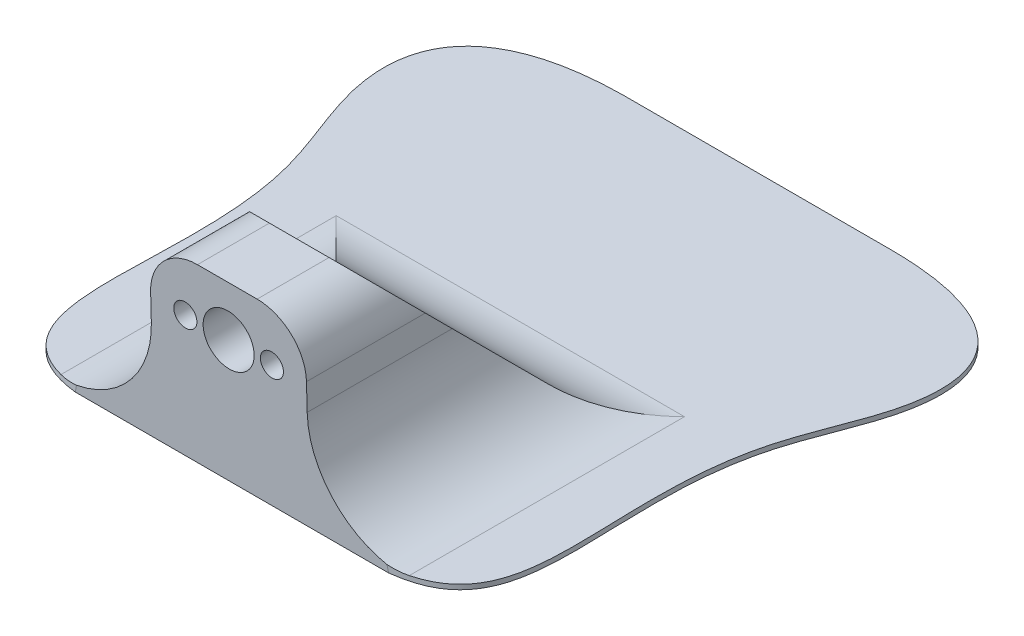
ISO-10303-21;
HEADER;
FILE_DESCRIPTION(('STEP AP214'),'2;1');
FILE_NAME('part.step','',(''),(''),'','','');
FILE_SCHEMA(('AUTOMOTIVE_DESIGN { 1 0 10303 214 1 1 1 1 }'));
ENDSEC;
DATA;
#1=APPLICATION_CONTEXT('core data for automotive mechanical design processes');
#2=APPLICATION_PROTOCOL_DEFINITION('international standard','automotive_design',2000,#1);
#3=PRODUCT_CONTEXT('',#1,'mechanical');
#4=PRODUCT('Part','Part','',(#3));
#5=PRODUCT_RELATED_PRODUCT_CATEGORY('part','',(#4));
#6=PRODUCT_DEFINITION_FORMATION('','',#4);
#7=PRODUCT_DEFINITION_CONTEXT('part definition',#1,'design');
#8=PRODUCT_DEFINITION('design','',#6,#7);
#9=PRODUCT_DEFINITION_SHAPE('','',#8);
#10=(LENGTH_UNIT() NAMED_UNIT(*) SI_UNIT(.MILLI.,.METRE.));
#11=(NAMED_UNIT(*) PLANE_ANGLE_UNIT() SI_UNIT($,.RADIAN.));
#12=(NAMED_UNIT(*) SI_UNIT($,.STERADIAN.) SOLID_ANGLE_UNIT());
#13=UNCERTAINTY_MEASURE_WITH_UNIT(LENGTH_MEASURE(1.E-05),#10,'distance_accuracy_value','');
#14=(GEOMETRIC_REPRESENTATION_CONTEXT(3) GLOBAL_UNCERTAINTY_ASSIGNED_CONTEXT((#13)) GLOBAL_UNIT_ASSIGNED_CONTEXT((#10,
#11,#12)) REPRESENTATION_CONTEXT('',''));
#15=CARTESIAN_POINT('',(0.,0.,0.));
#16=DIRECTION('',(0.,0.,1.));
#17=DIRECTION('',(1.,0.,0.));
#18=AXIS2_PLACEMENT_3D('',#15,#16,#17);
#19=CARTESIAN_POINT('',(-4.6739709889537,0.5,-25.2396955481044));
#20=DIRECTION('',(0.,-1.,0.));
#21=DIRECTION('',(0.,0.,-1.));
#22=AXIS2_PLACEMENT_3D('',#19,#20,#21);
#23=PLANE('',#22);
#24=DIRECTION('',(1.,0.,0.));
#25=VECTOR('',#24,1.);
#26=CARTESIAN_POINT('',(28.9884499999999,0.5,-21.7133491553784));
#27=LINE('',#26,#25);
#28=CARTESIAN_POINT('',(2.78844999999993,0.5,-21.7133491553784));
#29=VERTEX_POINT('',#28);
#30=CARTESIAN_POINT('',(38.9884499999999,0.5,-21.7133491553784));
#31=VERTEX_POINT('',#30);
#32=EDGE_CURVE('E152',#29,#31,#27,.T.);
#33=ORIENTED_EDGE('',*,*,#32,.T.);
#34=DIRECTION('',(0.,0.,-1.));
#35=VECTOR('',#34,1.);
#36=CARTESIAN_POINT('',(38.9884499999999,0.5,7.22878646835256));
#37=LINE('',#36,#35);
#38=CARTESIAN_POINT('',(38.9884500124217,0.5,6.8943912135416));
#39=VERTEX_POINT('',#38);
#40=EDGE_CURVE('E159',#31,#39,#37,.F.);
#41=ORIENTED_EDGE('',*,*,#40,.T.);
#42=CARTESIAN_POINT('',(36.3864345000184,0.5,7.32002908522591));
#43=CARTESIAN_POINT('',(36.6500242820969,0.5,7.28961487960146));
#44=CARTESIAN_POINT('',(36.9136140641755,0.5,7.25920067397702));
#45=CARTESIAN_POINT('',(37.177203846254,0.5,7.22878646835257));
#46=CARTESIAN_POINT('',(49.9434541489255,0.5,5.75575758727522));
#47=CARTESIAN_POINT('',(40.3835490058038,0.5,-12.5557863206709));
#48=CARTESIAN_POINT('',(53.7471422480391,0.5,-42.0087566636716));
#49=CARTESIAN_POINT('',(46.0041197782125,0.5,-47.3617429324616));
#50=CARTESIAN_POINT('',(34.939575722507,0.5,-47.4788841437172));
#51=B_SPLINE_CURVE_WITH_KNOTS('',3,(#42,#43,#44,#45,#46,#47,#48,#49,#50),.UNSPECIFIED.,.F.,.F.,
(4,3,1,1,4),(-0.01,0.,0.484322654770731,0.584322654770731,1.),.UNSPECIFIED.);
#52=CARTESIAN_POINT('',(34.939575722507,0.5,-47.4788841437172));
#53=VERTEX_POINT('',#52);
#54=EDGE_CURVE('E318',#39,#53,#51,.T.);
#55=ORIENTED_EDGE('',*,*,#54,.T.);
#56=DIRECTION('',(-1.,0.,0.));
#57=VECTOR('',#56,1.);
#58=CARTESIAN_POINT('',(6.83732427749298,0.5,-47.4788841437172));
#59=LINE('',#58,#57);
#60=CARTESIAN_POINT('',(6.83732427749298,0.5,-47.4788841437172));
#61=VERTEX_POINT('',#60);
#62=EDGE_CURVE('E245',#53,#61,#59,.T.);
#63=ORIENTED_EDGE('',*,*,#62,.T.);
#64=CARTESIAN_POINT('',(6.83732427749298,0.5,-47.4788841437172));
#65=CARTESIAN_POINT('',(-4.22721977821252,0.5,-47.3617429324616));
#66=CARTESIAN_POINT('',(-11.9702422480391,0.5,-42.0087566636716));
#67=CARTESIAN_POINT('',(1.39335099419624,0.5,-12.5557863206709));
#68=CARTESIAN_POINT('',(-8.16655414892549,0.5,5.75575758727522));
#69=CARTESIAN_POINT('',(4.599696153746,0.5,7.22878646835257));
#70=CARTESIAN_POINT('',(4.86328593582453,0.5,7.25920067397702));
#71=CARTESIAN_POINT('',(5.12687571790307,0.5,7.28961487960146));
#72=CARTESIAN_POINT('',(5.39046549998161,0.5,7.32002908522591));
#73=B_SPLINE_CURVE_WITH_KNOTS('',3,(#64,#65,#66,#67,#68,#69,#70,#71,#72),.UNSPECIFIED.,.F.,.F.,
(4,1,1,3,4),(0.,0.415677345229269,0.515677345229269,1.,1.01),.UNSPECIFIED.);
#74=CARTESIAN_POINT('',(2.78844998757792,0.5,6.8943912135415));
#75=VERTEX_POINT('',#74);
#76=EDGE_CURVE('E239',#61,#75,#73,.T.);
#77=ORIENTED_EDGE('',*,*,#76,.T.);
#78=DIRECTION('',(0.,0.,1.));
#79=VECTOR('',#78,1.);
#80=CARTESIAN_POINT('',(2.78844999999993,0.5,-17.5712135316475));
#81=LINE('',#80,#79);
#82=EDGE_CURVE('E149',#75,#29,#81,.F.);
#83=ORIENTED_EDGE('',*,*,#82,.T.);
#84=EDGE_LOOP('',(#33,#41,#55,#63,#77,#83));
#85=FACE_BOUND('',#84,.T.);
#86=ADVANCED_FACE('F34',(#85),#23,.F.);
#87=DIRECTION('',(0.,-1.,0.));
#88=VECTOR('',#87,1.);
#89=SURFACE_OF_LINEAR_EXTRUSION('',#73,#88);
#90=CARTESIAN_POINT('',(6.83732427749298,0.,-47.4788841437172));
#91=CARTESIAN_POINT('',(-4.22721977821252,0.,-47.3617429324616));
#92=CARTESIAN_POINT('',(-11.9702422480391,0.,-42.0087566636716));
#93=CARTESIAN_POINT('',(1.39335099419624,0.,-12.5557863206709));
#94=CARTESIAN_POINT('',(-8.16655414892549,0.,5.75575758727522));
#95=CARTESIAN_POINT('',(4.599696153746,0.,7.22878646835257));
#96=B_SPLINE_CURVE_WITH_KNOTS('',3,(#90,#91,#92,#93,#94,#95),.UNSPECIFIED.,.F.,.F.,(4,1,1,4),
(0.,0.415677345229269,0.515677345229269,1.),.UNSPECIFIED.);
#97=CARTESIAN_POINT('',(6.83732427749298,0.,-47.4788841437172));
#98=VERTEX_POINT('',#97);
#99=CARTESIAN_POINT('',(4.59969615374586,0.,7.22878646835257));
#100=VERTEX_POINT('',#99);
#101=EDGE_CURVE('E243',#98,#100,#96,.T.);
#102=ORIENTED_EDGE('',*,*,#101,.T.);
#103=CARTESIAN_POINT('',(5.55974244386924,4.23031023157279,7.33956104028986));
#104=CARTESIAN_POINT('',(5.23972701382816,2.82020682104853,7.30263618297743));
#105=CARTESIAN_POINT('',(4.91971158378708,1.41010341052427,7.26571132566501));
#106=CARTESIAN_POINT('',(4.599696153746,0.,7.22878646835258));
#107=B_SPLINE_CURVE_WITH_KNOTS('',3,(#103,#104,#105,#106),.UNSPECIFIED.,.F.,.F.,(4,4),(0.,
4.33929539675702),.UNSPECIFIED.);
#108=CARTESIAN_POINT('',(4.75760310470983,0.695794981222961,7.2470065011591));
#109=VERTEX_POINT('',#108);
#110=EDGE_CURVE('E54',#109,#100,#107,.T.);
#111=ORIENTED_EDGE('',*,*,#110,.F.);
#112=CARTESIAN_POINT('',(7.94876410123277,1.93430339221513,7.61521738537024));
#113=CARTESIAN_POINT('',(7.8185397477749,1.8558481551436,7.60019150016783));
#114=CARTESIAN_POINT('',(7.68654139562263,1.78037754063306,7.5849609202059));
#115=CARTESIAN_POINT('',(7.41925221802812,1.63553344413779,7.55411985951734));
#116=CARTESIAN_POINT('',(7.28396079035984,1.56616108824197,7.53850930930308));
#117=CARTESIAN_POINT('',(7.01037199565174,1.43366208977386,7.50694137492371));
#118=CARTESIAN_POINT('',(6.87207425299372,1.37053623319269,7.49098394741869));
#119=CARTESIAN_POINT('',(6.59276668808544,1.25066109334822,7.45875613931531));
#120=CARTESIAN_POINT('',(6.45175669208742,1.19391222020042,7.44248573866778));
#121=CARTESIAN_POINT('',(6.17086864402309,1.08824151701192,7.4100756238545));
#122=CARTESIAN_POINT('',(6.03104980496022,1.03916000326227,7.39394274003757));
#123=CARTESIAN_POINT('',(5.74940352127678,0.947267840793661,7.36144492960829));
#124=CARTESIAN_POINT('',(5.6075762916,0.904456526499824,7.34508002782696));
#125=CARTESIAN_POINT('',(5.39355462537564,0.845005818529113,7.32038567404525));
#126=CARTESIAN_POINT('',(5.32200512268738,0.825984335620318,7.31213024444259));
#127=CARTESIAN_POINT('',(5.17850514393236,0.789535739898241,7.29557168754518));
#128=CARTESIAN_POINT('',(5.10655466662855,0.772108632006693,7.28726856010327));
#129=CARTESIAN_POINT('',(4.96230726538062,0.738861684558242,7.2706277943966));
#130=CARTESIAN_POINT('',(4.89001043813777,0.723041420963189,7.26229016584412));
#131=CARTESIAN_POINT('',(4.78132162409226,0.700518796000133,7.24974030565067));
#132=CARTESIAN_POINT('',(4.74505130857059,0.693212528180663,7.24554976934542));
#133=CARTESIAN_POINT('',(4.67242964078505,0.679002625545482,7.23718724140127));
#134=CARTESIAN_POINT('',(4.63607828870988,0.672098989793265,7.23301524971926));
#135=CARTESIAN_POINT('',(4.57469743707804,0.660794431230181,7.22588080854615));
#136=CARTESIAN_POINT('',(4.5496841869695,0.656286292170405,7.22294833678208));
#137=CARTESIAN_POINT('',(4.49964135092248,0.647463788520553,7.21693651337868));
#138=CARTESIAN_POINT('',(4.4746117651042,0.643149422520676,7.21385716280832));
#139=CARTESIAN_POINT('',(4.39949938218127,0.63049655472066,7.20442929760614));
#140=CARTESIAN_POINT('',(4.3493911851425,0.622447956368572,7.19789076443767));
#141=CARTESIAN_POINT('',(4.24915468017341,0.60712826807159,7.18427566031628));
#142=CARTESIAN_POINT('',(4.19902639418293,0.599856798474209,7.17719935500037));
#143=CARTESIAN_POINT('',(4.09874458259897,0.586086041825539,7.16249311473654));
#144=CARTESIAN_POINT('',(4.04859105653316,0.579586769808635,7.15486316901411));
#145=CARTESIAN_POINT('',(3.89815689674463,0.561249905430508,7.13111990734865));
#146=CARTESIAN_POINT('',(3.79786668674859,0.550567769374469,7.11414830646827));
#147=CARTESIAN_POINT('',(3.5961835282013,0.532154134573792,7.07754725645148));
#148=CARTESIAN_POINT('',(3.49479264137807,0.524461586840095,7.05788695946069));
#149=CARTESIAN_POINT('',(3.29230173393441,0.512186250460437,7.01591388743383));
#150=CARTESIAN_POINT('',(3.19120194255127,0.507605466720039,6.99359941317231));
#151=CARTESIAN_POINT('',(2.98942194410813,0.50150867159369,6.94614718673769));
#152=CARTESIAN_POINT('',(2.88874254439162,0.499997054800256,6.92100544057632));
#153=CARTESIAN_POINT('',(2.78844999963088,0.5,6.89439121673995));
#154=B_SPLINE_CURVE_WITH_KNOTS('',3,(#112,#113,#114,#115,#116,#117,#118,#119,#120,#121,#122,
#123,#124,#125,#126,#127,#128,#129,#130,#131,#132,#133,#134,#135,#136,#137,#138,#139,#140,#141,
#142,#143,#144,#145,#146,#147,#148,#149,#150,#151,#152,#153),.UNSPECIFIED.,.F.,.F.,(4,2,2,2,2,2,
2,2,2,2,2,2,2,2,2,2,2,2,2,2,4),(0.,0.458276964730314,0.91663837672993,1.37505739076855,
1.83350586972253,2.28054125449008,2.72752915249064,2.95099510100084,3.17446173931294,
3.39786925183782,3.50957371598139,3.6212779202943,3.6980315730695,3.77478466733108,
3.92828540893553,4.0817108143419,4.23513920639161,4.54188585543004,4.85250485539088,
5.16332379743983,5.4745874732178),.UNSPECIFIED.);
#155=EDGE_CURVE('E45',#109,#75,#154,.T.);
#156=ORIENTED_EDGE('',*,*,#155,.T.);
#157=ORIENTED_EDGE('',*,*,#76,.F.);
#158=DIRECTION('',(0.,-1.,0.));
#159=VECTOR('',#158,1.);
#160=CARTESIAN_POINT('',(6.83732427749298,0.5,-47.4788841437172));
#161=LINE('',#160,#159);
#162=EDGE_CURVE('E231',#61,#98,#161,.T.);
#163=ORIENTED_EDGE('',*,*,#162,.T.);
#164=EDGE_LOOP('',(#102,#111,#156,#157,#163));
#165=FACE_BOUND('',#164,.T.);
#166=ADVANCED_FACE('F204',(#165),#89,.F.);
#167=CARTESIAN_POINT('',(4.59969615374586,0.,7.22878646835257));
#168=DIRECTION('',(0.,-0.0261769483078732,0.999657324975557));
#169=DIRECTION('',(0.,-0.999657324975557,-0.0261769483078732));
#170=AXIS2_PLACEMENT_3D('',#167,#168,#169);
#171=PLANE('',#170);
#172=CARTESIAN_POINT('',(25.3884499999999,13.,7.569203448752));
#173=DIRECTION('',(0.,-0.0261769483078732,0.999657324975557));
#174=DIRECTION('',(0.,0.999657324975557,0.0261769483078732));
#175=AXIS2_PLACEMENT_3D('',#172,#173,#174);
#176=ELLIPSE('',#175,1.20041135098904,1.2);
#177=CARTESIAN_POINT('',(25.3884499999999,14.2,7.60062655463502));
#178=VERTEX_POINT('',#177);
#179=EDGE_CURVE('E345',#178,#178,#176,.T.);
#180=ORIENTED_EDGE('',*,*,#179,.F.);
#181=EDGE_LOOP('',(#180));
#182=FACE_BOUND('',#181,.T.);
#183=CARTESIAN_POINT('',(16.3884499999999,13.,7.569203448752));
#184=DIRECTION('',(0.,-0.0261769483078732,0.999657324975557));
#185=DIRECTION('',(0.,0.999657324975557,0.0261769483078732));
#186=AXIS2_PLACEMENT_3D('',#183,#184,#185);
#187=ELLIPSE('',#186,1.20041135098904,1.2);
#188=CARTESIAN_POINT('',(16.3884499999999,14.2,7.60062655463502));
#189=VERTEX_POINT('',#188);
#190=EDGE_CURVE('E298',#189,#189,#187,.T.);
#191=ORIENTED_EDGE('',*,*,#190,.F.);
#192=EDGE_LOOP('',(#191));
#193=FACE_BOUND('',#192,.T.);
#194=CARTESIAN_POINT('',(20.8884499999999,13.,7.569203448752));
#195=DIRECTION('',(0.,-0.0261769483078732,0.999657324975557));
#196=DIRECTION('',(0.,0.999657324975557,0.0261769483078732));
#197=AXIS2_PLACEMENT_3D('',#194,#195,#196);
#198=ELLIPSE('',#197,2.6509084001008,2.65);
#199=CARTESIAN_POINT('',(20.8884499999999,15.65,7.63859614091034));
#200=VERTEX_POINT('',#199);
#201=EDGE_CURVE('E286',#200,#200,#198,.T.);
#202=ORIENTED_EDGE('',*,*,#201,.F.);
#203=EDGE_LOOP('',(#202));
#204=FACE_BOUND('',#203,.T.);
#205=DIRECTION('',(0.,0.999657324975557,0.0261769483078732));
#206=VECTOR('',#205,1.);
#207=CARTESIAN_POINT('',(28.9884499999999,18.2874602430044,7.7076604679755));
#208=LINE('',#207,#206);
#209=CARTESIAN_POINT('',(28.9884499999999,13.3,7.57705922522275));
#210=VERTEX_POINT('',#209);
#211=CARTESIAN_POINT('',(28.9884499999999,10.5,7.50373864482903));
#212=VERTEX_POINT('',#211);
#213=EDGE_CURVE('E123',#210,#212,#208,.F.);
#214=ORIENTED_EDGE('',*,*,#213,.F.);
#215=CARTESIAN_POINT('',(23.9884499999999,13.3,7.57705922522275));
#216=DIRECTION('',(0.,-0.0261769483078732,0.999657324975557));
#217=DIRECTION('',(0.,-0.999657324975557,-0.0261769483078732));
#218=AXIS2_PLACEMENT_3D('',#215,#216,#217);
#219=ELLIPSE('',#218,5.00171396245434,5.);
#220=CARTESIAN_POINT('',(23.9884499999999,18.3,7.70798883306869));
#221=VERTEX_POINT('',#220);
#222=EDGE_CURVE('E39',#210,#221,#219,.T.);
#223=ORIENTED_EDGE('',*,*,#222,.T.);
#224=DIRECTION('',(-1.,0.,0.));
#225=VECTOR('',#224,1.);
#226=CARTESIAN_POINT('',(0.,18.3,7.70798883306869));
#227=LINE('',#226,#225);
#228=CARTESIAN_POINT('',(17.7884499999999,18.3,7.70798883306869));
#229=VERTEX_POINT('',#228);
#230=EDGE_CURVE('E285',#229,#221,#227,.F.);
#231=ORIENTED_EDGE('',*,*,#230,.F.);
#232=CARTESIAN_POINT('',(17.7884499999999,13.3,7.57705922522275));
#233=DIRECTION('',(0.,-0.0261769483078732,0.999657324975557));
#234=DIRECTION('',(0.,0.999657324975557,0.0261769483078732));
#235=AXIS2_PLACEMENT_3D('',#232,#233,#234);
#236=ELLIPSE('',#235,5.00171396245434,5.);
#237=CARTESIAN_POINT('',(12.7884499999999,13.3,7.57705922522275));
#238=VERTEX_POINT('',#237);
#239=EDGE_CURVE('E281',#229,#238,#236,.T.);
#240=ORIENTED_EDGE('',*,*,#239,.T.);
#241=DIRECTION('',(0.,0.999657324975557,0.0261769483078732));
#242=VECTOR('',#241,1.);
#243=CARTESIAN_POINT('',(12.7884499999999,0.,7.22878646835257));
#244=LINE('',#243,#242);
#245=CARTESIAN_POINT('',(12.7884499999999,10.5,7.50373864482903));
#246=VERTEX_POINT('',#245);
#247=EDGE_CURVE('E142',#238,#246,#244,.F.);
#248=ORIENTED_EDGE('',*,*,#247,.T.);
#249=CARTESIAN_POINT('',(2.78844999999993,10.5,7.50373864482903));
#250=DIRECTION('',(0.,-0.0261769483078732,0.999657324975557));
#251=DIRECTION('',(0.,-0.999657324975557,-0.0261769483078732));
#252=AXIS2_PLACEMENT_3D('',#249,#250,#251);
#253=ELLIPSE('',#252,10.0034279249087,10.);
#254=EDGE_CURVE('E131',#246,#109,#253,.F.);
#255=ORIENTED_EDGE('',*,*,#254,.T.);
#256=ORIENTED_EDGE('',*,*,#110,.T.);
#257=DIRECTION('',(1.,0.,0.));
#258=VECTOR('',#257,1.);
#259=CARTESIAN_POINT('',(4.59969615374586,0.,7.22878646835257));
#260=LINE('',#259,#258);
#261=CARTESIAN_POINT('',(37.177203846254,0.,7.22878646835257));
#262=VERTEX_POINT('',#261);
#263=EDGE_CURVE('E248',#100,#262,#260,.T.);
#264=ORIENTED_EDGE('',*,*,#263,.T.);
#265=CARTESIAN_POINT('',(37.0192968952628,0.695794981228514,7.24700650115925));
#266=CARTESIAN_POINT('',(37.0719325455932,0.463863320819013,7.24093315689036));
#267=CARTESIAN_POINT('',(37.1245681959236,0.231931660409513,7.23485981262147));
#268=CARTESIAN_POINT('',(37.177203846254,0.,7.22878646835257));
#269=B_SPLINE_CURVE_WITH_KNOTS('',3,(#265,#266,#267,#268),.UNSPECIFIED.,.F.,.F.,(4,4),(0.,
0.713720695138924),.UNSPECIFIED.);
#270=CARTESIAN_POINT('',(37.0192968952628,0.695794981228514,7.24700650115925));
#271=VERTEX_POINT('',#270);
#272=EDGE_CURVE('E126',#271,#262,#269,.T.);
#273=ORIENTED_EDGE('',*,*,#272,.F.);
#274=CARTESIAN_POINT('',(38.9884499999999,10.5,7.50373864482903));
#275=DIRECTION('',(0.,-0.0261769483078732,0.999657324975557));
#276=DIRECTION('',(0.,0.999657324975557,0.0261769483078732));
#277=AXIS2_PLACEMENT_3D('',#274,#275,#276);
#278=ELLIPSE('',#277,10.0034279249087,10.);
#279=EDGE_CURVE('E121',#271,#212,#278,.F.);
#280=ORIENTED_EDGE('',*,*,#279,.T.);
#281=EDGE_LOOP('',(#214,#223,#231,#240,#248,#255,#256,#264,#273,#280));
#282=FACE_BOUND('',#281,.T.);
#283=ADVANCED_FACE('F36',(#182,#193,#204,#282),#171,.T.);
#284=DIRECTION('',(0.,-1.,0.));
#285=VECTOR('',#284,1.);
#286=SURFACE_OF_LINEAR_EXTRUSION('',#51,#285);
#287=CARTESIAN_POINT('',(37.177203846254,0.,7.22878646835257));
#288=CARTESIAN_POINT('',(49.9434541489255,0.,5.75575758727522));
#289=CARTESIAN_POINT('',(40.3835490058038,0.,-12.5557863206709));
#290=CARTESIAN_POINT('',(53.7471422480391,0.,-42.0087566636716));
#291=CARTESIAN_POINT('',(46.0041197782125,0.,-47.3617429324616));
#292=CARTESIAN_POINT('',(34.939575722507,0.,-47.4788841437172));
#293=B_SPLINE_CURVE_WITH_KNOTS('',3,(#287,#288,#289,#290,#291,#292),.UNSPECIFIED.,.F.,.F.,(4,1,
1,4),(0.,0.484322654770731,0.584322654770731,1.),.UNSPECIFIED.);
#294=CARTESIAN_POINT('',(34.939575722507,0.,-47.4788841437172));
#295=VERTEX_POINT('',#294);
#296=EDGE_CURVE('E240',#262,#295,#293,.T.);
#297=ORIENTED_EDGE('',*,*,#296,.T.);
#298=DIRECTION('',(0.,-1.,0.));
#299=VECTOR('',#298,1.);
#300=CARTESIAN_POINT('',(34.939575722507,0.5,-47.4788841437172));
#301=LINE('',#300,#299);
#302=EDGE_CURVE('E235',#53,#295,#301,.T.);
#303=ORIENTED_EDGE('',*,*,#302,.F.);
#304=ORIENTED_EDGE('',*,*,#54,.F.);
#305=CARTESIAN_POINT('',(38.9884499999999,0.5,6.8943912135416));
#306=CARTESIAN_POINT('',(38.8881574556844,0.499997054796199,6.92100543937762));
#307=CARTESIAN_POINT('',(38.78747805612,0.501508671587089,6.9461471863672));
#308=CARTESIAN_POINT('',(38.5856980577536,0.507605466710531,6.99359941341701));
#309=CARTESIAN_POINT('',(38.4845982662956,0.51218625044962,7.01591388746784));
#310=CARTESIAN_POINT('',(38.2821073587726,0.524461586827823,7.05788695934783));
#311=CARTESIAN_POINT('',(38.1807164719448,0.532154134561324,7.0775472564023));
#312=CARTESIAN_POINT('',(37.9790333133779,0.550567769362027,7.11414830646769));
#313=CARTESIAN_POINT('',(37.8787431033671,0.561249905418016,7.13111990733413));
#314=CARTESIAN_POINT('',(37.7283089435585,0.579586769796871,7.15486316899808));
#315=CARTESIAN_POINT('',(37.6781554174851,0.586086041814351,7.16249311472341));
#316=CARTESIAN_POINT('',(37.5778736058857,0.59985679846439,7.17719935499111));
#317=CARTESIAN_POINT('',(37.5277453198874,0.607128268062561,7.18427566030797));
#318=CARTESIAN_POINT('',(37.4275088149016,0.622447956361527,7.19789076443172));
#319=CARTESIAN_POINT('',(37.3774006178541,0.630496554714824,7.20442929760159));
#320=CARTESIAN_POINT('',(37.3022882349179,0.643149422516856,7.21385716280561));
#321=CARTESIAN_POINT('',(37.2772586490952,0.647463788517442,7.21693651337654));
#322=CARTESIAN_POINT('',(37.2272158130393,0.656286292168795,7.22294833678102));
#323=CARTESIAN_POINT('',(37.2022025629264,0.660794431229363,7.2258808085456));
#324=CARTESIAN_POINT('',(37.1408217111619,0.672098989816884,7.23301524973421));
#325=CARTESIAN_POINT('',(37.1044703589587,0.679002625594132,7.23718724143088));
#326=CARTESIAN_POINT('',(37.0318486909177,0.693212528282231,7.24554976940442));
#327=CARTESIAN_POINT('',(36.9955783752686,0.700518796129589,7.2497403057244));
#328=CARTESIAN_POINT('',(36.8868895608417,0.723041421180547,7.26229016596191));
#329=CARTESIAN_POINT('',(36.8145927333458,0.73886168483986,7.27062779454356));
#330=CARTESIAN_POINT('',(36.6703453315958,0.772108632427807,7.28726856030814));
#331=CARTESIAN_POINT('',(36.598394854043,0.789535740394567,7.29557168777879));
#332=CARTESIAN_POINT('',(36.454894874793,0.825984336278162,7.31213024473332));
#333=CARTESIAN_POINT('',(36.3833453718589,0.845005819273263,7.32038567436435));
#334=CARTESIAN_POINT('',(36.1693237049038,0.904456527518968,7.34508002823037));
#335=CARTESIAN_POINT('',(36.0274964747474,0.947267842017948,7.36144493006705));
#336=CARTESIAN_POINT('',(35.7458501901224,1.0391600049395,7.39394274060496));
#337=CARTESIAN_POINT('',(35.6060313505977,1.08824151893693,7.41007562447518));
#338=CARTESIAN_POINT('',(35.3251433015872,1.19391222268112,7.44248573939764));
#339=CARTESIAN_POINT('',(35.184133305106,1.25066109613932,7.45875614010092));
#340=CARTESIAN_POINT('',(34.9048257392555,1.37053623665016,7.49098394831302));
#341=CARTESIAN_POINT('',(34.7665279961385,1.43366209358734,7.506941375871));
#342=CARTESIAN_POINT('',(34.4929392005392,1.56616109281187,7.5385093103532));
#343=CARTESIAN_POINT('',(34.3576477724387,1.63553344910817,7.55411986061734));
#344=CARTESIAN_POINT('',(34.0903585940085,1.78037754644754,7.58496092140231));
#345=CARTESIAN_POINT('',(33.958360241453,1.8558481614018,7.60019150141077));
#346=CARTESIAN_POINT('',(33.828135887609,1.93430339893718,7.61521738665773));
#347=B_SPLINE_CURVE_WITH_KNOTS('',3,(#305,#306,#307,#308,#309,#310,#311,#312,#313,#314,#315,
#316,#317,#318,#319,#320,#321,#322,#323,#324,#325,#326,#327,#328,#329,#330,#331,#332,#333,#334,
#335,#336,#337,#338,#339,#340,#341,#342,#343,#344,#345,#346),.UNSPECIFIED.,.F.,.F.,(4,2,2,2,2,2,
2,2,2,2,2,2,2,2,2,2,2,2,2,2,4),(0.,0.311263675937683,0.622082618050765,0.932701618070729,
1.23944826714181,1.39287665921579,1.54630206464589,1.69980280627727,1.77655590055242,
1.85330955334119,1.96501375804785,2.07671822258518,2.3001257358975,2.52359237499343,
2.74705832428747,3.19404622385063,3.64108161017843,4.09953009083138,4.55794910657155,
5.0163105202779,5.47458748672286),.UNSPECIFIED.);
#348=EDGE_CURVE('E132',#39,#271,#347,.T.);
#349=ORIENTED_EDGE('',*,*,#348,.T.);
#350=ORIENTED_EDGE('',*,*,#272,.T.);
#351=EDGE_LOOP('',(#297,#303,#304,#349,#350));
#352=FACE_BOUND('',#351,.T.);
#353=ADVANCED_FACE('F178',(#352),#286,.F.);
#354=CARTESIAN_POINT('',(6.83732427749298,0.5,-47.4788841437172));
#355=DIRECTION('',(0.,0.,1.));
#356=DIRECTION('',(1.,0.,0.));
#357=AXIS2_PLACEMENT_3D('',#354,#355,#356);
#358=PLANE('',#357);
#359=DIRECTION('',(-1.,0.,0.));
#360=VECTOR('',#359,1.);
#361=CARTESIAN_POINT('',(6.83732427749298,0.,-47.4788841437172));
#362=LINE('',#361,#360);
#363=EDGE_CURVE('E228',#295,#98,#362,.T.);
#364=ORIENTED_EDGE('',*,*,#363,.T.);
#365=ORIENTED_EDGE('',*,*,#162,.F.);
#366=ORIENTED_EDGE('',*,*,#62,.F.);
#367=ORIENTED_EDGE('',*,*,#302,.T.);
#368=EDGE_LOOP('',(#364,#365,#366,#367));
#369=FACE_BOUND('',#368,.T.);
#370=ADVANCED_FACE('F216',(#369),#358,.F.);
#371=CARTESIAN_POINT('',(-4.6739709889537,0.,-25.2396955481044));
#372=DIRECTION('',(0.,-1.,0.));
#373=DIRECTION('',(0.,0.,-1.));
#374=AXIS2_PLACEMENT_3D('',#371,#372,#373);
#375=PLANE('',#374);
#376=ORIENTED_EDGE('',*,*,#101,.F.);
#377=ORIENTED_EDGE('',*,*,#363,.F.);
#378=ORIENTED_EDGE('',*,*,#296,.F.);
#379=ORIENTED_EDGE('',*,*,#263,.F.);
#380=EDGE_LOOP('',(#376,#377,#378,#379));
#381=FACE_BOUND('',#380,.T.);
#382=ADVANCED_FACE('F214',(#381),#375,.T.);
#383=CARTESIAN_POINT('',(12.7884499999999,18.3,7.22878646835257));
#384=DIRECTION('',(1.,0.,0.));
#385=DIRECTION('',(0.,0.,-1.));
#386=AXIS2_PLACEMENT_3D('',#383,#384,#385);
#387=PLANE('',#386);
#388=DIRECTION('',(0.,0.707106781186546,0.707106781186549));
#389=VECTOR('',#388,1.);
#390=CARTESIAN_POINT('',(12.7884499999999,21.8,3.72878646835258));
#391=LINE('',#390,#389);
#392=CARTESIAN_POINT('',(12.7884499999999,13.3,-4.77121353164745));
#393=VERTEX_POINT('',#392);
#394=CARTESIAN_POINT('',(12.7884499999999,10.5,-7.57121353164746));
#395=VERTEX_POINT('',#394);
#396=EDGE_CURVE('E269',#393,#395,#391,.F.);
#397=ORIENTED_EDGE('',*,*,#396,.T.);
#398=DIRECTION('',(0.,0.,1.));
#399=VECTOR('',#398,1.);
#400=CARTESIAN_POINT('',(12.7884499999999,10.5,7.22878646835257));
#401=LINE('',#400,#399);
#402=EDGE_CURVE('E163',#395,#246,#401,.T.);
#403=ORIENTED_EDGE('',*,*,#402,.T.);
#404=ORIENTED_EDGE('',*,*,#247,.F.);
#405=DIRECTION('',(0.,0.,1.));
#406=VECTOR('',#405,1.);
#407=CARTESIAN_POINT('',(12.7884499999999,13.3,7.22878646835257));
#408=LINE('',#407,#406);
#409=EDGE_CURVE('E150',#238,#393,#408,.F.);
#410=ORIENTED_EDGE('',*,*,#409,.T.);
#411=EDGE_LOOP('',(#397,#403,#404,#410));
#412=FACE_BOUND('',#411,.T.);
#413=ADVANCED_FACE('F212',(#412),#387,.F.);
#414=CARTESIAN_POINT('',(28.9884499999999,18.3,7.22878646835257));
#415=DIRECTION('',(-1.,0.,0.));
#416=DIRECTION('',(0.,0.,1.));
#417=AXIS2_PLACEMENT_3D('',#414,#415,#416);
#418=PLANE('',#417);
#419=ORIENTED_EDGE('',*,*,#213,.T.);
#420=DIRECTION('',(0.,0.,-1.));
#421=VECTOR('',#420,1.);
#422=CARTESIAN_POINT('',(28.9884499999999,10.5,-17.5712135316475));
#423=LINE('',#422,#421);
#424=CARTESIAN_POINT('',(28.9884499999999,10.5,-7.57121353164746));
#425=VERTEX_POINT('',#424);
#426=EDGE_CURVE('E139',#212,#425,#423,.T.);
#427=ORIENTED_EDGE('',*,*,#426,.T.);
#428=DIRECTION('',(0.,0.707106781186546,0.707106781186549));
#429=VECTOR('',#428,1.);
#430=CARTESIAN_POINT('',(28.9884499999999,18.3,0.228786468352561));
#431=LINE('',#430,#429);
#432=CARTESIAN_POINT('',(28.9884499999999,13.3,-4.77121353164746));
#433=VERTEX_POINT('',#432);
#434=EDGE_CURVE('E143',#433,#425,#431,.F.);
#435=ORIENTED_EDGE('',*,*,#434,.F.);
#436=DIRECTION('',(0.,0.,-1.));
#437=VECTOR('',#436,1.);
#438=CARTESIAN_POINT('',(28.9884499999999,13.3,7.22878646835257));
#439=LINE('',#438,#437);
#440=EDGE_CURVE('E141',#433,#210,#439,.F.);
#441=ORIENTED_EDGE('',*,*,#440,.T.);
#442=EDGE_LOOP('',(#419,#427,#435,#441));
#443=FACE_BOUND('',#442,.T.);
#444=ADVANCED_FACE('F137',(#443),#418,.F.);
#445=CARTESIAN_POINT('',(12.7884499999999,18.3,0.228786468352565));
#446=DIRECTION('',(0.,0.707106781186549,-0.707106781186546));
#447=DIRECTION('',(0.,0.707106781186546,0.707106781186549));
#448=AXIS2_PLACEMENT_3D('',#445,#446,#447);
#449=PLANE('',#448);
#450=CARTESIAN_POINT('',(20.8884499999999,13.,-5.07121353164745));
#451=DIRECTION('',(0.,0.707106781186549,-0.707106781186546));
#452=DIRECTION('',(0.,0.707106781186546,0.707106781186549));
#453=AXIS2_PLACEMENT_3D('',#450,#451,#452);
#454=ELLIPSE('',#453,6.36396103067894,4.5);
#455=CARTESIAN_POINT('',(20.8884499999999,17.5,-0.571213531647435));
#456=VERTEX_POINT('',#455);
#457=EDGE_CURVE('E156',#456,#456,#454,.F.);
#458=ORIENTED_EDGE('',*,*,#457,.T.);
#459=EDGE_LOOP('',(#458));
#460=FACE_BOUND('',#459,.T.);
#461=CARTESIAN_POINT('',(38.9884499999999,10.5,-7.57121353164746));
#462=DIRECTION('',(0.,0.707106781186549,-0.707106781186546));
#463=DIRECTION('',(0.,0.707106781186546,0.707106781186549));
#464=AXIS2_PLACEMENT_3D('',#461,#462,#463);
#465=ELLIPSE('',#464,14.142135623731,10.);
#466=CARTESIAN_POINT('',(31.9173821881345,3.42893218813451,-14.642281343513));
#467=VERTEX_POINT('',#466);
#468=EDGE_CURVE('E148',#425,#467,#465,.F.);
#469=ORIENTED_EDGE('',*,*,#468,.T.);
#470=DIRECTION('',(-1.,0.,0.));
#471=VECTOR('',#470,1.);
#472=CARTESIAN_POINT('',(12.7884499999999,3.42893218813451,-14.642281343513));
#473=LINE('',#472,#471);
#474=CARTESIAN_POINT('',(9.85951781186539,3.42893218813451,-14.642281343513));
#475=VERTEX_POINT('',#474);
#476=EDGE_CURVE('E161',#467,#475,#473,.T.);
#477=ORIENTED_EDGE('',*,*,#476,.T.);
#478=CARTESIAN_POINT('',(2.78844999999993,10.5,-7.57121353164746));
#479=DIRECTION('',(0.,0.707106781186549,-0.707106781186546));
#480=DIRECTION('',(0.,-0.707106781186546,-0.707106781186549));
#481=AXIS2_PLACEMENT_3D('',#478,#479,#480);
#482=ELLIPSE('',#481,14.142135623731,10.);
#483=EDGE_CURVE('E11',#475,#395,#482,.F.);
#484=ORIENTED_EDGE('',*,*,#483,.T.);
#485=ORIENTED_EDGE('',*,*,#396,.F.);
#486=CARTESIAN_POINT('',(17.7884499999999,13.3,-4.77121353164745));
#487=DIRECTION('',(0.,0.707106781186549,-0.707106781186546));
#488=DIRECTION('',(0.,0.707106781186546,0.707106781186549));
#489=AXIS2_PLACEMENT_3D('',#486,#487,#488);
#490=ELLIPSE('',#489,7.07106781186549,5.);
#491=CARTESIAN_POINT('',(17.7884499999999,18.3,0.228786468352565));
#492=VERTEX_POINT('',#491);
#493=EDGE_CURVE('E278',#393,#492,#490,.T.);
#494=ORIENTED_EDGE('',*,*,#493,.T.);
#495=DIRECTION('',(-1.,0.,0.));
#496=VECTOR('',#495,1.);
#497=CARTESIAN_POINT('',(12.7884499999999,18.3,0.228786468352565));
#498=LINE('',#497,#496);
#499=CARTESIAN_POINT('',(23.9884499999999,18.3,0.228786468352565));
#500=VERTEX_POINT('',#499);
#501=EDGE_CURVE('E272',#500,#492,#498,.T.);
#502=ORIENTED_EDGE('',*,*,#501,.F.);
#503=CARTESIAN_POINT('',(23.9884499999999,13.3,-4.77121353164745));
#504=DIRECTION('',(0.,0.707106781186549,-0.707106781186546));
#505=DIRECTION('',(0.,-0.707106781186546,-0.707106781186549));
#506=AXIS2_PLACEMENT_3D('',#503,#504,#505);
#507=ELLIPSE('',#506,7.07106781186549,5.);
#508=EDGE_CURVE('E88',#500,#433,#507,.T.);
#509=ORIENTED_EDGE('',*,*,#508,.T.);
#510=ORIENTED_EDGE('',*,*,#434,.T.);
#511=EDGE_LOOP('',(#469,#477,#484,#485,#494,#502,#509,#510));
#512=FACE_BOUND('',#511,.T.);
#513=ADVANCED_FACE('F313',(#460,#512),#449,.T.);
#514=CARTESIAN_POINT('',(0.,18.3,0.));
#515=DIRECTION('',(0.,-1.,0.));
#516=DIRECTION('',(0.,0.,-1.));
#517=AXIS2_PLACEMENT_3D('',#514,#515,#516);
#518=PLANE('',#517);
#519=ORIENTED_EDGE('',*,*,#230,.T.);
#520=DIRECTION('',(0.,0.,-1.));
#521=VECTOR('',#520,1.);
#522=CARTESIAN_POINT('',(23.9884499999999,18.3,0.));
#523=LINE('',#522,#521);
#524=EDGE_CURVE('E276',#221,#500,#523,.T.);
#525=ORIENTED_EDGE('',*,*,#524,.T.);
#526=ORIENTED_EDGE('',*,*,#501,.T.);
#527=DIRECTION('',(0.,0.,1.));
#528=VECTOR('',#527,1.);
#529=CARTESIAN_POINT('',(17.7884499999999,18.3,0.));
#530=LINE('',#529,#528);
#531=EDGE_CURVE('E273',#492,#229,#530,.T.);
#532=ORIENTED_EDGE('',*,*,#531,.T.);
#533=EDGE_LOOP('',(#519,#525,#526,#532));
#534=FACE_BOUND('',#533,.T.);
#535=ADVANCED_FACE('F384',(#534),#518,.F.);
#536=CARTESIAN_POINT('',(23.9884499999999,13.3,0.));
#537=DIRECTION('',(0.,0.,-1.));
#538=DIRECTION('',(-1.,0.,0.));
#539=AXIS2_PLACEMENT_3D('',#536,#537,#538);
#540=CYLINDRICAL_SURFACE('',#539,5.);
#541=ORIENTED_EDGE('',*,*,#222,.F.);
#542=ORIENTED_EDGE('',*,*,#440,.F.);
#543=ORIENTED_EDGE('',*,*,#508,.F.);
#544=ORIENTED_EDGE('',*,*,#524,.F.);
#545=EDGE_LOOP('',(#541,#542,#543,#544));
#546=FACE_BOUND('',#545,.T.);
#547=ADVANCED_FACE('F386',(#546),#540,.T.);
#548=CARTESIAN_POINT('',(17.7884499999999,13.3,0.));
#549=DIRECTION('',(0.,0.,1.));
#550=DIRECTION('',(1.,0.,0.));
#551=AXIS2_PLACEMENT_3D('',#548,#549,#550);
#552=CYLINDRICAL_SURFACE('',#551,5.);
#553=ORIENTED_EDGE('',*,*,#493,.F.);
#554=ORIENTED_EDGE('',*,*,#409,.F.);
#555=ORIENTED_EDGE('',*,*,#239,.F.);
#556=ORIENTED_EDGE('',*,*,#531,.F.);
#557=EDGE_LOOP('',(#553,#554,#555,#556));
#558=FACE_BOUND('',#557,.T.);
#559=ADVANCED_FACE('F187',(#558),#552,.T.);
#560=CARTESIAN_POINT('',(20.8884499999999,13.,3.22878646835257));
#561=DIRECTION('',(0.,0.,1.));
#562=DIRECTION('',(1.,0.,0.));
#563=AXIS2_PLACEMENT_3D('',#560,#561,#562);
#564=CYLINDRICAL_SURFACE('',#563,2.65);
#565=CARTESIAN_POINT('',(20.8884499999999,13.,3.22878646835257));
#566=DIRECTION('',(0.,0.,1.));
#567=DIRECTION('',(1.,0.,0.));
#568=AXIS2_PLACEMENT_3D('',#565,#566,#567);
#569=CIRCLE('',#568,2.65);
#570=CARTESIAN_POINT('',(23.5384499999999,13.,3.22878646835257));
#571=VERTEX_POINT('',#570);
#572=EDGE_CURVE('E291',#571,#571,#569,.T.);
#573=ORIENTED_EDGE('',*,*,#572,.F.);
#574=EDGE_LOOP('',(#573));
#575=FACE_BOUND('',#574,.T.);
#576=ORIENTED_EDGE('',*,*,#201,.T.);
#577=EDGE_LOOP('',(#576));
#578=FACE_BOUND('',#577,.T.);
#579=ADVANCED_FACE('F371',(#575,#578),#564,.F.);
#580=CARTESIAN_POINT('',(20.8884499999999,13.,-16.7712135316474));
#581=DIRECTION('',(0.,0.,1.));
#582=DIRECTION('',(1.,0.,0.));
#583=AXIS2_PLACEMENT_3D('',#580,#581,#582);
#584=CYLINDRICAL_SURFACE('',#583,4.5);
#585=CARTESIAN_POINT('',(20.8884499999999,13.,3.22878646835257));
#586=DIRECTION('',(0.,0.,1.));
#587=DIRECTION('',(1.,0.,0.));
#588=AXIS2_PLACEMENT_3D('',#585,#586,#587);
#589=CIRCLE('',#588,4.5);
#590=CARTESIAN_POINT('',(25.3884499999999,13.,3.22878646835257));
#591=VERTEX_POINT('',#590);
#592=EDGE_CURVE('E352',#591,#591,#589,.T.);
#593=ORIENTED_EDGE('',*,*,#592,.T.);
#594=EDGE_LOOP('',(#593));
#595=FACE_BOUND('',#594,.T.);
#596=ORIENTED_EDGE('',*,*,#457,.F.);
#597=EDGE_LOOP('',(#596));
#598=FACE_BOUND('',#597,.T.);
#599=ADVANCED_FACE('F368',(#595,#598),#584,.F.);
#600=CARTESIAN_POINT('',(20.8884499999999,13.,3.22878646835257));
#601=DIRECTION('',(0.,0.,1.));
#602=DIRECTION('',(1.,0.,0.));
#603=AXIS2_PLACEMENT_3D('',#600,#601,#602);
#604=PLANE('',#603);
#605=ORIENTED_EDGE('',*,*,#572,.T.);
#606=EDGE_LOOP('',(#605));
#607=FACE_BOUND('',#606,.T.);
#608=ORIENTED_EDGE('',*,*,#592,.F.);
#609=EDGE_LOOP('',(#608));
#610=FACE_BOUND('',#609,.T.);
#611=ADVANCED_FACE('F370',(#607,#610),#604,.F.);
#612=CARTESIAN_POINT('',(16.3884499999999,13.,4.72878646835257));
#613=DIRECTION('',(0.,0.,1.));
#614=DIRECTION('',(1.,0.,0.));
#615=AXIS2_PLACEMENT_3D('',#612,#613,#614);
#616=CYLINDRICAL_SURFACE('',#615,1.2);
#617=CARTESIAN_POINT('',(16.3884499999999,13.,4.72878646835257));
#618=DIRECTION('',(0.,0.,1.));
#619=DIRECTION('',(1.,0.,0.));
#620=AXIS2_PLACEMENT_3D('',#617,#618,#619);
#621=CIRCLE('',#620,1.2);
#622=CARTESIAN_POINT('',(17.5884499999999,13.,4.72878646835257));
#623=VERTEX_POINT('',#622);
#624=EDGE_CURVE('E348',#623,#623,#621,.T.);
#625=ORIENTED_EDGE('',*,*,#624,.F.);
#626=EDGE_LOOP('',(#625));
#627=FACE_BOUND('',#626,.T.);
#628=ORIENTED_EDGE('',*,*,#190,.T.);
#629=EDGE_LOOP('',(#628));
#630=FACE_BOUND('',#629,.T.);
#631=ADVANCED_FACE('F377',(#627,#630),#616,.F.);
#632=CARTESIAN_POINT('',(16.3884499999999,13.,4.72878646835257));
#633=DIRECTION('',(0.,0.,1.));
#634=DIRECTION('',(1.,0.,0.));
#635=AXIS2_PLACEMENT_3D('',#632,#633,#634);
#636=PLANE('',#635);
#637=ORIENTED_EDGE('',*,*,#624,.T.);
#638=EDGE_LOOP('',(#637));
#639=FACE_BOUND('',#638,.T.);
#640=ADVANCED_FACE('F425',(#639),#636,.T.);
#641=CARTESIAN_POINT('',(25.3884499999999,13.,4.72878646835257));
#642=DIRECTION('',(0.,0.,1.));
#643=DIRECTION('',(1.,0.,0.));
#644=AXIS2_PLACEMENT_3D('',#641,#642,#643);
#645=CYLINDRICAL_SURFACE('',#644,1.2);
#646=CARTESIAN_POINT('',(25.3884499999999,13.,4.72878646835257));
#647=DIRECTION('',(0.,0.,1.));
#648=DIRECTION('',(1.,0.,0.));
#649=AXIS2_PLACEMENT_3D('',#646,#647,#648);
#650=CIRCLE('',#649,1.2);
#651=CARTESIAN_POINT('',(26.5884499999999,13.,4.72878646835257));
#652=VERTEX_POINT('',#651);
#653=EDGE_CURVE('E347',#652,#652,#650,.T.);
#654=ORIENTED_EDGE('',*,*,#653,.F.);
#655=EDGE_LOOP('',(#654));
#656=FACE_BOUND('',#655,.T.);
#657=ORIENTED_EDGE('',*,*,#179,.T.);
#658=EDGE_LOOP('',(#657));
#659=FACE_BOUND('',#658,.T.);
#660=ADVANCED_FACE('F199',(#656,#659),#645,.F.);
#661=CARTESIAN_POINT('',(25.3884499999999,13.,4.72878646835257));
#662=DIRECTION('',(0.,0.,1.));
#663=DIRECTION('',(1.,0.,0.));
#664=AXIS2_PLACEMENT_3D('',#661,#662,#663);
#665=PLANE('',#664);
#666=ORIENTED_EDGE('',*,*,#653,.T.);
#667=EDGE_LOOP('',(#666));
#668=FACE_BOUND('',#667,.T.);
#669=ADVANCED_FACE('F194',(#668),#665,.T.);
#670=CARTESIAN_POINT('',(2.78844999999993,10.5,7.22878646835257));
#671=DIRECTION('',(0.,0.,-1.));
#672=DIRECTION('',(-1.,0.,0.));
#673=AXIS2_PLACEMENT_3D('',#670,#671,#672);
#674=CYLINDRICAL_SURFACE('',#673,10.);
#675=ORIENTED_EDGE('',*,*,#402,.F.);
#676=ORIENTED_EDGE('',*,*,#483,.F.);
#677=CARTESIAN_POINT('',(2.78844999999993,10.5,-21.7133491553784));
#678=DIRECTION('',(0.707106781186547,0.,-0.707106781186547));
#679=DIRECTION('',(-0.707106781186547,0.,-0.707106781186547));
#680=AXIS2_PLACEMENT_3D('',#677,#678,#679);
#681=ELLIPSE('',#680,14.1421356237309,10.);
#682=EDGE_CURVE('E342',#29,#475,#681,.F.);
#683=ORIENTED_EDGE('',*,*,#682,.F.);
#684=ORIENTED_EDGE('',*,*,#82,.F.);
#685=ORIENTED_EDGE('',*,*,#155,.F.);
#686=ORIENTED_EDGE('',*,*,#254,.F.);
#687=EDGE_LOOP('',(#675,#676,#683,#684,#685,#686));
#688=FACE_BOUND('',#687,.T.);
#689=ADVANCED_FACE('F190',(#688),#674,.F.);
#690=CARTESIAN_POINT('',(12.7884499999999,10.5,-21.7133491553784));
#691=DIRECTION('',(-1.,0.,0.));
#692=DIRECTION('',(0.,0.,1.));
#693=AXIS2_PLACEMENT_3D('',#690,#691,#692);
#694=CYLINDRICAL_SURFACE('',#693,10.);
#695=ORIENTED_EDGE('',*,*,#476,.F.);
#696=CARTESIAN_POINT('',(38.9884499999999,10.5,-21.7133491553784));
#697=DIRECTION('',(-0.707106781186548,0.,-0.707106781186547));
#698=DIRECTION('',(-0.707106781186547,0.,0.707106781186548));
#699=AXIS2_PLACEMENT_3D('',#696,#697,#698);
#700=ELLIPSE('',#699,14.1421356237309,10.);
#701=EDGE_CURVE('E339',#31,#467,#700,.T.);
#702=ORIENTED_EDGE('',*,*,#701,.F.);
#703=ORIENTED_EDGE('',*,*,#32,.F.);
#704=ORIENTED_EDGE('',*,*,#682,.T.);
#705=EDGE_LOOP('',(#695,#702,#703,#704));
#706=FACE_BOUND('',#705,.T.);
#707=ADVANCED_FACE('F186',(#706),#694,.F.);
#708=CARTESIAN_POINT('',(38.9884499999999,10.5,7.22878646835256));
#709=DIRECTION('',(0.,0.,1.));
#710=DIRECTION('',(1.,0.,0.));
#711=AXIS2_PLACEMENT_3D('',#708,#709,#710);
#712=CYLINDRICAL_SURFACE('',#711,10.);
#713=ORIENTED_EDGE('',*,*,#348,.F.);
#714=ORIENTED_EDGE('',*,*,#40,.F.);
#715=ORIENTED_EDGE('',*,*,#701,.T.);
#716=ORIENTED_EDGE('',*,*,#468,.F.);
#717=ORIENTED_EDGE('',*,*,#426,.F.);
#718=ORIENTED_EDGE('',*,*,#279,.F.);
#719=EDGE_LOOP('',(#713,#714,#715,#716,#717,#718));
#720=FACE_BOUND('',#719,.T.);
#721=ADVANCED_FACE('F145',(#720),#712,.F.);
#722=CLOSED_SHELL('',(#86,#166,#283,#353,#370,#382,#413,#444,#513,#535,#547,#559,#579,#599,#611,
#631,#640,#660,#669,#689,#707,#721));
#723=MANIFOLD_SOLID_BREP('B2',#722);
#724=ADVANCED_BREP_SHAPE_REPRESENTATION('',(#18,#723),#14);
#725=SHAPE_DEFINITION_REPRESENTATION(#9,#724);
ENDSEC;
END-ISO-10303-21;
